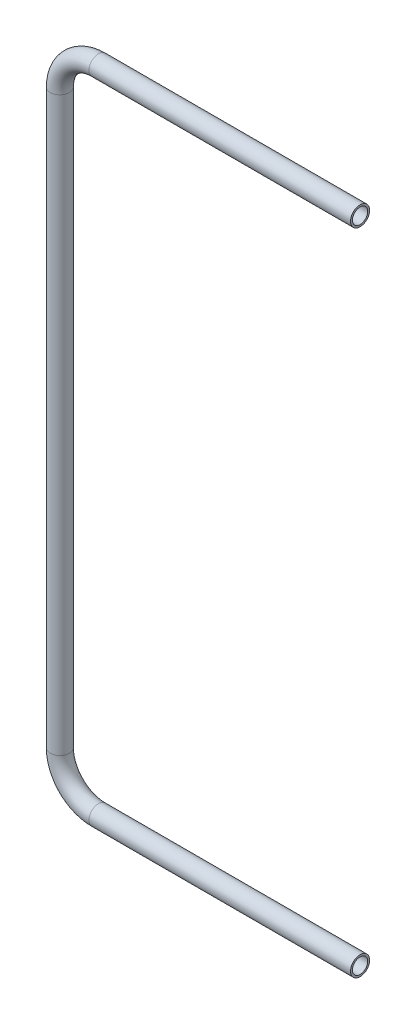
ISO-10303-21;
HEADER;
FILE_DESCRIPTION(('STEP AP214'),'2;1');
FILE_NAME('part.step','',(''),(''),'','','');
FILE_SCHEMA(('AUTOMOTIVE_DESIGN { 1 0 10303 214 1 1 1 1 }'));
ENDSEC;
DATA;
#1=APPLICATION_CONTEXT('core data for automotive mechanical design processes');
#2=APPLICATION_PROTOCOL_DEFINITION('international standard','automotive_design',2000,#1);
#3=PRODUCT_CONTEXT('',#1,'mechanical');
#4=PRODUCT('Part','Part','',(#3));
#5=PRODUCT_RELATED_PRODUCT_CATEGORY('part','',(#4));
#6=PRODUCT_DEFINITION_FORMATION('','',#4);
#7=PRODUCT_DEFINITION_CONTEXT('part definition',#1,'design');
#8=PRODUCT_DEFINITION('design','',#6,#7);
#9=PRODUCT_DEFINITION_SHAPE('','',#8);
#10=(LENGTH_UNIT() NAMED_UNIT(*) SI_UNIT(.MILLI.,.METRE.));
#11=(NAMED_UNIT(*) PLANE_ANGLE_UNIT() SI_UNIT($,.RADIAN.));
#12=(NAMED_UNIT(*) SI_UNIT($,.STERADIAN.) SOLID_ANGLE_UNIT());
#13=UNCERTAINTY_MEASURE_WITH_UNIT(LENGTH_MEASURE(1.E-05),#10,'distance_accuracy_value','');
#14=(GEOMETRIC_REPRESENTATION_CONTEXT(3) GLOBAL_UNCERTAINTY_ASSIGNED_CONTEXT((#13)) GLOBAL_UNIT_ASSIGNED_CONTEXT((#10,
#11,#12)) REPRESENTATION_CONTEXT('',''));
#15=CARTESIAN_POINT('',(0.,0.,0.));
#16=DIRECTION('',(0.,0.,1.));
#17=DIRECTION('',(1.,0.,0.));
#18=AXIS2_PLACEMENT_3D('',#15,#16,#17);
#19=CARTESIAN_POINT('',(0.,0.,0.));
#20=DIRECTION('',(-1.,0.,0.));
#21=DIRECTION('',(0.,-1.,0.));
#22=AXIS2_PLACEMENT_3D('',#19,#20,#21);
#23=CYLINDRICAL_SURFACE('',#22,16.7005);
#24=CARTESIAN_POINT('',(-457.2,0.,0.));
#25=DIRECTION('',(-1.,0.,0.));
#26=DIRECTION('',(0.,0.,1.));
#27=AXIS2_PLACEMENT_3D('',#24,#25,#26);
#28=CIRCLE('',#27,16.7005);
#29=CARTESIAN_POINT('',(-457.2,-16.7005000000001,0.));
#30=VERTEX_POINT('',#29);
#31=EDGE_CURVE('E97',#30,#30,#28,.T.);
#32=ORIENTED_EDGE('',*,*,#31,.F.);
#33=EDGE_LOOP('',(#32));
#34=FACE_BOUND('',#33,.T.);
#35=CARTESIAN_POINT('',(0.,0.,0.));
#36=DIRECTION('',(-1.,0.,0.));
#37=DIRECTION('',(0.,0.,1.));
#38=AXIS2_PLACEMENT_3D('',#35,#36,#37);
#39=CIRCLE('',#38,16.7005);
#40=CARTESIAN_POINT('',(0.,0.,16.7005));
#41=VERTEX_POINT('',#40);
#42=EDGE_CURVE('E59',#41,#41,#39,.T.);
#43=ORIENTED_EDGE('',*,*,#42,.T.);
#44=EDGE_LOOP('',(#43));
#45=FACE_BOUND('',#44,.T.);
#46=ADVANCED_FACE('F43',(#34,#45),#23,.T.);
#47=CARTESIAN_POINT('',(-457.2,67.5004999999999,0.));
#48=DIRECTION('',(0.,0.,1.));
#49=DIRECTION('',(-1.,0.,0.));
#50=AXIS2_PLACEMENT_3D('',#47,#48,#49);
#51=TOROIDAL_SURFACE('',#50,67.5005,16.7005);
#52=CARTESIAN_POINT('',(-524.7005,67.5004999999999,0.));
#53=DIRECTION('',(0.,1.,0.));
#54=DIRECTION('',(0.,0.,1.));
#55=AXIS2_PLACEMENT_3D('',#52,#53,#54);
#56=CIRCLE('',#55,16.7005);
#57=CARTESIAN_POINT('',(-541.401,67.5004999999999,0.));
#58=VERTEX_POINT('',#57);
#59=EDGE_CURVE('E101',#58,#58,#56,.T.);
#60=CARTESIAN_POINT('',(-457.2,67.5004999999999,0.));
#61=DIRECTION('',(0.,0.,1.));
#62=DIRECTION('',(-1.,0.,0.));
#63=AXIS2_PLACEMENT_3D('',#60,#61,#62);
#64=CIRCLE('',#63,84.201);
#65=EDGE_CURVE('',#58,#30,#64,.T.);
#66=ORIENTED_EDGE('',*,*,#59,.F.);
#67=ORIENTED_EDGE('',*,*,#31,.T.);
#68=ORIENTED_EDGE('',*,*,#65,.T.);
#69=ORIENTED_EDGE('',*,*,#65,.F.);
#70=EDGE_LOOP('',(#66,#68,#67,#69));
#71=FACE_BOUND('',#70,.T.);
#72=ADVANCED_FACE('F123',(#71),#51,.T.);
#73=CARTESIAN_POINT('',(-524.7005,67.5004999999999,0.));
#74=DIRECTION('',(0.,1.,0.));
#75=DIRECTION('',(-1.,0.,0.));
#76=AXIS2_PLACEMENT_3D('',#73,#74,#75);
#77=CYLINDRICAL_SURFACE('',#76,16.7005);
#78=CARTESIAN_POINT('',(-524.7005,1067.562,0.));
#79=DIRECTION('',(0.,1.,0.));
#80=DIRECTION('',(0.,0.,1.));
#81=AXIS2_PLACEMENT_3D('',#78,#79,#80);
#82=CIRCLE('',#81,16.7005);
#83=CARTESIAN_POINT('',(-541.401,1067.562,0.));
#84=VERTEX_POINT('',#83);
#85=EDGE_CURVE('E104',#84,#84,#82,.T.);
#86=ORIENTED_EDGE('',*,*,#85,.F.);
#87=EDGE_LOOP('',(#86));
#88=FACE_BOUND('',#87,.T.);
#89=ORIENTED_EDGE('',*,*,#59,.T.);
#90=EDGE_LOOP('',(#89));
#91=FACE_BOUND('',#90,.T.);
#92=ADVANCED_FACE('F116',(#88,#91),#77,.T.);
#93=CARTESIAN_POINT('',(-457.2,1067.562,0.));
#94=DIRECTION('',(0.,0.,1.));
#95=DIRECTION('',(-1.,0.,0.));
#96=AXIS2_PLACEMENT_3D('',#93,#94,#95);
#97=TOROIDAL_SURFACE('',#96,67.5005,16.7005);
#98=CARTESIAN_POINT('',(-457.2,1135.0625,0.));
#99=DIRECTION('',(1.,0.,0.));
#100=DIRECTION('',(0.,0.,1.));
#101=AXIS2_PLACEMENT_3D('',#98,#99,#100);
#102=CIRCLE('',#101,16.7005);
#103=CARTESIAN_POINT('',(-457.2,1151.763,0.));
#104=VERTEX_POINT('',#103);
#105=EDGE_CURVE('E47',#104,#104,#102,.T.);
#106=CARTESIAN_POINT('',(-457.2,1067.562,0.));
#107=DIRECTION('',(0.,0.,1.));
#108=DIRECTION('',(-1.,0.,0.));
#109=AXIS2_PLACEMENT_3D('',#106,#107,#108);
#110=CIRCLE('',#109,84.201);
#111=EDGE_CURVE('',#104,#84,#110,.T.);
#112=ORIENTED_EDGE('',*,*,#105,.F.);
#113=ORIENTED_EDGE('',*,*,#85,.T.);
#114=ORIENTED_EDGE('',*,*,#111,.T.);
#115=ORIENTED_EDGE('',*,*,#111,.F.);
#116=EDGE_LOOP('',(#112,#114,#113,#115));
#117=FACE_BOUND('',#116,.T.);
#118=ADVANCED_FACE('F114',(#117),#97,.T.);
#119=CARTESIAN_POINT('',(-457.2,1135.0625,0.));
#120=DIRECTION('',(1.,0.,0.));
#121=DIRECTION('',(0.,1.,0.));
#122=AXIS2_PLACEMENT_3D('',#119,#120,#121);
#123=CYLINDRICAL_SURFACE('',#122,16.7005);
#124=CARTESIAN_POINT('',(-3.33066907387547E-13,1135.0625,0.));
#125=DIRECTION('',(1.,0.,0.));
#126=DIRECTION('',(0.,0.,1.));
#127=AXIS2_PLACEMENT_3D('',#124,#125,#126);
#128=CIRCLE('',#127,16.7005);
#129=CARTESIAN_POINT('',(-3.33066907387547E-13,1135.0625,16.7005));
#130=VERTEX_POINT('',#129);
#131=EDGE_CURVE('E64',#130,#130,#128,.T.);
#132=ORIENTED_EDGE('',*,*,#131,.F.);
#133=EDGE_LOOP('',(#132));
#134=FACE_BOUND('',#133,.T.);
#135=ORIENTED_EDGE('',*,*,#105,.T.);
#136=EDGE_LOOP('',(#135));
#137=FACE_BOUND('',#136,.T.);
#138=ADVANCED_FACE('F45',(#134,#137),#123,.T.);
#139=CARTESIAN_POINT('',(0.,0.,0.));
#140=DIRECTION('',(1.,0.,0.));
#141=DIRECTION('',(0.,0.,1.));
#142=AXIS2_PLACEMENT_3D('',#139,#140,#141);
#143=PLANE('',#142);
#144=CARTESIAN_POINT('',(0.,0.,0.));
#145=DIRECTION('',(-1.,0.,0.));
#146=DIRECTION('',(0.,0.,1.));
#147=AXIS2_PLACEMENT_3D('',#144,#145,#146);
#148=CIRCLE('',#147,13.335);
#149=CARTESIAN_POINT('',(0.,0.,13.335));
#150=VERTEX_POINT('',#149);
#151=EDGE_CURVE('E94',#150,#150,#148,.F.);
#152=ORIENTED_EDGE('',*,*,#151,.F.);
#153=EDGE_LOOP('',(#152));
#154=FACE_BOUND('',#153,.T.);
#155=ORIENTED_EDGE('',*,*,#42,.F.);
#156=EDGE_LOOP('',(#155));
#157=FACE_BOUND('',#156,.T.);
#158=ADVANCED_FACE('F121',(#154,#157),#143,.T.);
#159=CARTESIAN_POINT('',(-3.33066907387547E-13,1135.0625,0.));
#160=DIRECTION('',(-1.,0.,0.));
#161=DIRECTION('',(0.,0.,1.));
#162=AXIS2_PLACEMENT_3D('',#159,#160,#161);
#163=PLANE('',#162);
#164=CARTESIAN_POINT('',(-3.33066907387547E-13,1135.0625,0.));
#165=DIRECTION('',(1.,0.,0.));
#166=DIRECTION('',(0.,0.,1.));
#167=AXIS2_PLACEMENT_3D('',#164,#165,#166);
#168=CIRCLE('',#167,13.335);
#169=CARTESIAN_POINT('',(-3.33066907387547E-13,1135.0625,13.335));
#170=VERTEX_POINT('',#169);
#171=EDGE_CURVE('E11',#170,#170,#168,.F.);
#172=ORIENTED_EDGE('',*,*,#171,.T.);
#173=EDGE_LOOP('',(#172));
#174=FACE_BOUND('',#173,.T.);
#175=ORIENTED_EDGE('',*,*,#131,.T.);
#176=EDGE_LOOP('',(#175));
#177=FACE_BOUND('',#176,.T.);
#178=ADVANCED_FACE('F71',(#174,#177),#163,.F.);
#179=CARTESIAN_POINT('',(0.,0.,0.));
#180=DIRECTION('',(-1.,0.,0.));
#181=DIRECTION('',(0.,-1.,0.));
#182=AXIS2_PLACEMENT_3D('',#179,#180,#181);
#183=CYLINDRICAL_SURFACE('',#182,13.335);
#184=CARTESIAN_POINT('',(-457.2,0.,0.));
#185=DIRECTION('',(-1.,0.,0.));
#186=DIRECTION('',(0.,0.,1.));
#187=AXIS2_PLACEMENT_3D('',#184,#185,#186);
#188=CIRCLE('',#187,13.335);
#189=CARTESIAN_POINT('',(-457.2,-13.3350000000001,0.));
#190=VERTEX_POINT('',#189);
#191=EDGE_CURVE('E159',#190,#190,#188,.F.);
#192=ORIENTED_EDGE('',*,*,#191,.F.);
#193=EDGE_LOOP('',(#192));
#194=FACE_BOUND('',#193,.T.);
#195=ORIENTED_EDGE('',*,*,#151,.T.);
#196=EDGE_LOOP('',(#195));
#197=FACE_BOUND('',#196,.T.);
#198=ADVANCED_FACE('F140',(#194,#197),#183,.F.);
#199=CARTESIAN_POINT('',(-457.2,67.5004999999999,0.));
#200=DIRECTION('',(0.,0.,1.));
#201=DIRECTION('',(-1.,0.,0.));
#202=AXIS2_PLACEMENT_3D('',#199,#200,#201);
#203=TOROIDAL_SURFACE('',#202,67.5005,13.335);
#204=CARTESIAN_POINT('',(-524.7005,67.5004999999999,0.));
#205=DIRECTION('',(0.,1.,0.));
#206=DIRECTION('',(0.,0.,1.));
#207=AXIS2_PLACEMENT_3D('',#204,#205,#206);
#208=CIRCLE('',#207,13.335);
#209=CARTESIAN_POINT('',(-538.0355,67.5004999999999,0.));
#210=VERTEX_POINT('',#209);
#211=EDGE_CURVE('E88',#210,#210,#208,.F.);
#212=CARTESIAN_POINT('',(-457.2,67.5004999999999,0.));
#213=DIRECTION('',(0.,0.,1.));
#214=DIRECTION('',(-1.,0.,0.));
#215=AXIS2_PLACEMENT_3D('',#212,#213,#214);
#216=CIRCLE('',#215,80.8355);
#217=EDGE_CURVE('',#210,#190,#216,.T.);
#218=ORIENTED_EDGE('',*,*,#211,.F.);
#219=ORIENTED_EDGE('',*,*,#191,.T.);
#220=ORIENTED_EDGE('',*,*,#217,.T.);
#221=ORIENTED_EDGE('',*,*,#217,.F.);
#222=EDGE_LOOP('',(#218,#220,#219,#221));
#223=FACE_BOUND('',#222,.T.);
#224=ADVANCED_FACE('F147',(#223),#203,.F.);
#225=CARTESIAN_POINT('',(-524.7005,67.5004999999999,0.));
#226=DIRECTION('',(0.,1.,0.));
#227=DIRECTION('',(-1.,0.,0.));
#228=AXIS2_PLACEMENT_3D('',#225,#226,#227);
#229=CYLINDRICAL_SURFACE('',#228,13.335);
#230=CARTESIAN_POINT('',(-524.7005,1067.562,0.));
#231=DIRECTION('',(0.,1.,0.));
#232=DIRECTION('',(0.,0.,1.));
#233=AXIS2_PLACEMENT_3D('',#230,#231,#232);
#234=CIRCLE('',#233,13.335);
#235=CARTESIAN_POINT('',(-538.0355,1067.562,0.));
#236=VERTEX_POINT('',#235);
#237=EDGE_CURVE('E82',#236,#236,#234,.F.);
#238=ORIENTED_EDGE('',*,*,#237,.F.);
#239=EDGE_LOOP('',(#238));
#240=FACE_BOUND('',#239,.T.);
#241=ORIENTED_EDGE('',*,*,#211,.T.);
#242=EDGE_LOOP('',(#241));
#243=FACE_BOUND('',#242,.T.);
#244=ADVANCED_FACE('F144',(#240,#243),#229,.F.);
#245=CARTESIAN_POINT('',(-457.2,1067.562,0.));
#246=DIRECTION('',(0.,0.,1.));
#247=DIRECTION('',(-1.,0.,0.));
#248=AXIS2_PLACEMENT_3D('',#245,#246,#247);
#249=TOROIDAL_SURFACE('',#248,67.5005,13.335);
#250=CARTESIAN_POINT('',(-457.2,1135.0625,0.));
#251=DIRECTION('',(1.,0.,0.));
#252=DIRECTION('',(0.,0.,1.));
#253=AXIS2_PLACEMENT_3D('',#250,#251,#252);
#254=CIRCLE('',#253,13.335);
#255=CARTESIAN_POINT('',(-457.2,1148.3975,0.));
#256=VERTEX_POINT('',#255);
#257=EDGE_CURVE('E53',#256,#256,#254,.F.);
#258=CARTESIAN_POINT('',(-457.2,1067.562,0.));
#259=DIRECTION('',(0.,0.,1.));
#260=DIRECTION('',(-1.,0.,0.));
#261=AXIS2_PLACEMENT_3D('',#258,#259,#260);
#262=CIRCLE('',#261,80.8355);
#263=EDGE_CURVE('',#256,#236,#262,.T.);
#264=ORIENTED_EDGE('',*,*,#257,.F.);
#265=ORIENTED_EDGE('',*,*,#237,.T.);
#266=ORIENTED_EDGE('',*,*,#263,.T.);
#267=ORIENTED_EDGE('',*,*,#263,.F.);
#268=EDGE_LOOP('',(#264,#266,#265,#267));
#269=FACE_BOUND('',#268,.T.);
#270=ADVANCED_FACE('F76',(#269),#249,.F.);
#271=CARTESIAN_POINT('',(-457.2,1135.0625,0.));
#272=DIRECTION('',(1.,0.,0.));
#273=DIRECTION('',(0.,1.,0.));
#274=AXIS2_PLACEMENT_3D('',#271,#272,#273);
#275=CYLINDRICAL_SURFACE('',#274,13.335);
#276=ORIENTED_EDGE('',*,*,#171,.F.);
#277=EDGE_LOOP('',(#276));
#278=FACE_BOUND('',#277,.T.);
#279=ORIENTED_EDGE('',*,*,#257,.T.);
#280=EDGE_LOOP('',(#279));
#281=FACE_BOUND('',#280,.T.);
#282=ADVANCED_FACE('F73',(#278,#281),#275,.F.);
#283=CLOSED_SHELL('',(#46,#72,#92,#118,#138,#158,#178,#198,#224,#244,#270,#282));
#284=MANIFOLD_SOLID_BREP('B2',#283);
#285=ADVANCED_BREP_SHAPE_REPRESENTATION('',(#18,#284),#14);
#286=SHAPE_DEFINITION_REPRESENTATION(#9,#285);
ENDSEC;
END-ISO-10303-21;
